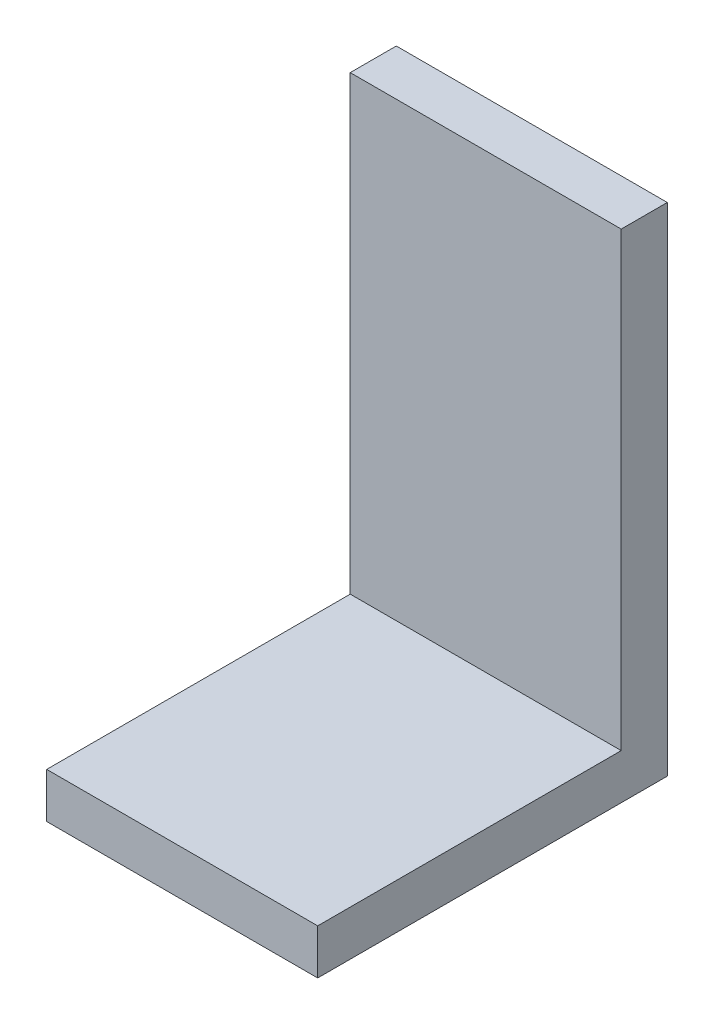
ISO-10303-21;
HEADER;
FILE_DESCRIPTION(('STEP AP214'),'2;1');
FILE_NAME('part.step','',(''),(''),'','','');
FILE_SCHEMA(('AUTOMOTIVE_DESIGN { 1 0 10303 214 1 1 1 1 }'));
ENDSEC;
DATA;
#1=APPLICATION_CONTEXT('core data for automotive mechanical design processes');
#2=APPLICATION_PROTOCOL_DEFINITION('international standard','automotive_design',2000,#1);
#3=PRODUCT_CONTEXT('',#1,'mechanical');
#4=PRODUCT('Part','Part','',(#3));
#5=PRODUCT_RELATED_PRODUCT_CATEGORY('part','',(#4));
#6=PRODUCT_DEFINITION_FORMATION('','',#4);
#7=PRODUCT_DEFINITION_CONTEXT('part definition',#1,'design');
#8=PRODUCT_DEFINITION('design','',#6,#7);
#9=PRODUCT_DEFINITION_SHAPE('','',#8);
#10=(LENGTH_UNIT() NAMED_UNIT(*) SI_UNIT(.MILLI.,.METRE.));
#11=(NAMED_UNIT(*) PLANE_ANGLE_UNIT() SI_UNIT($,.RADIAN.));
#12=(NAMED_UNIT(*) SI_UNIT($,.STERADIAN.) SOLID_ANGLE_UNIT());
#13=UNCERTAINTY_MEASURE_WITH_UNIT(LENGTH_MEASURE(1.E-05),#10,'distance_accuracy_value','');
#14=(GEOMETRIC_REPRESENTATION_CONTEXT(3) GLOBAL_UNCERTAINTY_ASSIGNED_CONTEXT((#13)) GLOBAL_UNIT_ASSIGNED_CONTEXT((#10,
#11,#12)) REPRESENTATION_CONTEXT('',''));
#15=CARTESIAN_POINT('',(0.,0.,0.));
#16=DIRECTION('',(0.,0.,1.));
#17=DIRECTION('',(1.,0.,0.));
#18=AXIS2_PLACEMENT_3D('',#15,#16,#17);
#19=CARTESIAN_POINT('',(0.9,-4.55,0.));
#20=DIRECTION('',(1.,0.,0.));
#21=DIRECTION('',(0.,0.,1.));
#22=AXIS2_PLACEMENT_3D('',#19,#20,#21);
#23=PLANE('',#22);
#24=DIRECTION('',(0.,-1.,0.));
#25=VECTOR('',#24,1.);
#26=CARTESIAN_POINT('',(0.9,-4.,0.));
#27=LINE('',#26,#25);
#28=CARTESIAN_POINT('',(0.9,-4.,0.));
#29=VERTEX_POINT('',#28);
#30=CARTESIAN_POINT('',(0.9,-4.55,0.));
#31=VERTEX_POINT('',#30);
#32=EDGE_CURVE('E11',#29,#31,#27,.T.);
#33=ORIENTED_EDGE('',*,*,#32,.F.);
#34=DIRECTION('',(0.,0.,-1.));
#35=VECTOR('',#34,1.);
#36=CARTESIAN_POINT('',(0.9,-4.,0.051));
#37=LINE('',#36,#35);
#38=CARTESIAN_POINT('',(0.9,-4.,0.051));
#39=VERTEX_POINT('',#38);
#40=EDGE_CURVE('E24',#39,#29,#37,.T.);
#41=ORIENTED_EDGE('',*,*,#40,.F.);
#42=DIRECTION('',(0.,1.,0.));
#43=VECTOR('',#42,1.);
#44=CARTESIAN_POINT('',(0.9,-4.5,0.051));
#45=LINE('',#44,#43);
#46=CARTESIAN_POINT('',(0.9,-4.5,0.051));
#47=VERTEX_POINT('',#46);
#48=EDGE_CURVE('E87',#47,#39,#45,.T.);
#49=ORIENTED_EDGE('',*,*,#48,.F.);
#50=DIRECTION('',(0.,0.,-1.));
#51=VECTOR('',#50,1.);
#52=CARTESIAN_POINT('',(0.9,-4.5,0.387));
#53=LINE('',#52,#51);
#54=CARTESIAN_POINT('',(0.9,-4.5,0.387));
#55=VERTEX_POINT('',#54);
#56=EDGE_CURVE('E114',#55,#47,#53,.T.);
#57=ORIENTED_EDGE('',*,*,#56,.F.);
#58=DIRECTION('',(0.,1.,0.));
#59=VECTOR('',#58,1.);
#60=CARTESIAN_POINT('',(0.9,-4.55,0.387));
#61=LINE('',#60,#59);
#62=CARTESIAN_POINT('',(0.9,-4.55,0.387));
#63=VERTEX_POINT('',#62);
#64=EDGE_CURVE('E111',#63,#55,#61,.T.);
#65=ORIENTED_EDGE('',*,*,#64,.F.);
#66=DIRECTION('',(0.,0.,1.));
#67=VECTOR('',#66,1.);
#68=CARTESIAN_POINT('',(0.9,-4.55,0.));
#69=LINE('',#68,#67);
#70=EDGE_CURVE('E108',#31,#63,#69,.T.);
#71=ORIENTED_EDGE('',*,*,#70,.F.);
#72=EDGE_LOOP('',(#33,#41,#49,#57,#65,#71));
#73=FACE_BOUND('',#72,.T.);
#74=ADVANCED_FACE('F17',(#73),#23,.T.);
#75=CARTESIAN_POINT('',(0.6,-4.,0.));
#76=DIRECTION('',(-1.,0.,0.));
#77=DIRECTION('',(0.,0.,1.));
#78=AXIS2_PLACEMENT_3D('',#75,#76,#77);
#79=PLANE('',#78);
#80=DIRECTION('',(0.,1.,0.));
#81=VECTOR('',#80,1.);
#82=CARTESIAN_POINT('',(0.6,-4.55,0.));
#83=LINE('',#82,#81);
#84=CARTESIAN_POINT('',(0.6,-4.55,0.));
#85=VERTEX_POINT('',#84);
#86=CARTESIAN_POINT('',(0.6,-4.,0.));
#87=VERTEX_POINT('',#86);
#88=EDGE_CURVE('E106',#85,#87,#83,.T.);
#89=ORIENTED_EDGE('',*,*,#88,.F.);
#90=DIRECTION('',(0.,0.,-1.));
#91=VECTOR('',#90,1.);
#92=CARTESIAN_POINT('',(0.6,-4.55,0.387));
#93=LINE('',#92,#91);
#94=CARTESIAN_POINT('',(0.6,-4.55,0.387));
#95=VERTEX_POINT('',#94);
#96=EDGE_CURVE('E103',#95,#85,#93,.T.);
#97=ORIENTED_EDGE('',*,*,#96,.F.);
#98=DIRECTION('',(0.,-1.,0.));
#99=VECTOR('',#98,1.);
#100=CARTESIAN_POINT('',(0.6,-4.5,0.387));
#101=LINE('',#100,#99);
#102=CARTESIAN_POINT('',(0.6,-4.5,0.387));
#103=VERTEX_POINT('',#102);
#104=EDGE_CURVE('E100',#103,#95,#101,.T.);
#105=ORIENTED_EDGE('',*,*,#104,.F.);
#106=DIRECTION('',(0.,0.,1.));
#107=VECTOR('',#106,1.);
#108=CARTESIAN_POINT('',(0.6,-4.5,0.051));
#109=LINE('',#108,#107);
#110=CARTESIAN_POINT('',(0.6,-4.5,0.051));
#111=VERTEX_POINT('',#110);
#112=EDGE_CURVE('E72',#111,#103,#109,.T.);
#113=ORIENTED_EDGE('',*,*,#112,.F.);
#114=DIRECTION('',(0.,-1.,0.));
#115=VECTOR('',#114,1.);
#116=CARTESIAN_POINT('',(0.6,-4.,0.051));
#117=LINE('',#116,#115);
#118=CARTESIAN_POINT('',(0.6,-4.,0.051));
#119=VERTEX_POINT('',#118);
#120=EDGE_CURVE('E66',#119,#111,#117,.T.);
#121=ORIENTED_EDGE('',*,*,#120,.F.);
#122=DIRECTION('',(0.,0.,1.));
#123=VECTOR('',#122,1.);
#124=CARTESIAN_POINT('',(0.6,-4.,0.));
#125=LINE('',#124,#123);
#126=EDGE_CURVE('E69',#87,#119,#125,.T.);
#127=ORIENTED_EDGE('',*,*,#126,.F.);
#128=EDGE_LOOP('',(#89,#97,#105,#113,#121,#127));
#129=FACE_BOUND('',#128,.T.);
#130=ADVANCED_FACE('F68',(#129),#79,.T.);
#131=CARTESIAN_POINT('',(0.9,-4.55,0.387));
#132=DIRECTION('',(0.,0.,1.));
#133=DIRECTION('',(0.,1.,0.));
#134=AXIS2_PLACEMENT_3D('',#131,#132,#133);
#135=PLANE('',#134);
#136=ORIENTED_EDGE('',*,*,#64,.T.);
#137=DIRECTION('',(1.,0.,0.));
#138=VECTOR('',#137,1.);
#139=CARTESIAN_POINT('',(0.6,-4.5,0.387));
#140=LINE('',#139,#138);
#141=EDGE_CURVE('E83',#103,#55,#140,.T.);
#142=ORIENTED_EDGE('',*,*,#141,.F.);
#143=ORIENTED_EDGE('',*,*,#104,.T.);
#144=DIRECTION('',(-1.,0.,0.));
#145=VECTOR('',#144,1.);
#146=CARTESIAN_POINT('',(0.9,-4.55,0.387));
#147=LINE('',#146,#145);
#148=EDGE_CURVE('E88',#63,#95,#147,.T.);
#149=ORIENTED_EDGE('',*,*,#148,.F.);
#150=EDGE_LOOP('',(#136,#142,#143,#149));
#151=FACE_BOUND('',#150,.T.);
#152=ADVANCED_FACE('F125',(#151),#135,.T.);
#153=CARTESIAN_POINT('',(0.9,-4.5,0.051));
#154=DIRECTION('',(0.,0.,1.));
#155=DIRECTION('',(0.,1.,0.));
#156=AXIS2_PLACEMENT_3D('',#153,#154,#155);
#157=PLANE('',#156);
#158=ORIENTED_EDGE('',*,*,#48,.T.);
#159=DIRECTION('',(1.,0.,0.));
#160=VECTOR('',#159,1.);
#161=CARTESIAN_POINT('',(0.6,-4.,0.051));
#162=LINE('',#161,#160);
#163=EDGE_CURVE('E81',#119,#39,#162,.T.);
#164=ORIENTED_EDGE('',*,*,#163,.F.);
#165=ORIENTED_EDGE('',*,*,#120,.T.);
#166=DIRECTION('',(-1.,0.,0.));
#167=VECTOR('',#166,1.);
#168=CARTESIAN_POINT('',(0.9,-4.5,0.051));
#169=LINE('',#168,#167);
#170=EDGE_CURVE('E89',#47,#111,#169,.T.);
#171=ORIENTED_EDGE('',*,*,#170,.F.);
#172=EDGE_LOOP('',(#158,#164,#165,#171));
#173=FACE_BOUND('',#172,.T.);
#174=ADVANCED_FACE('F86',(#173),#157,.T.);
#175=CARTESIAN_POINT('',(0.6,-4.55,0.));
#176=DIRECTION('',(0.,-1.,0.));
#177=DIRECTION('',(0.,0.,1.));
#178=AXIS2_PLACEMENT_3D('',#175,#176,#177);
#179=PLANE('',#178);
#180=DIRECTION('',(-1.,0.,0.));
#181=VECTOR('',#180,1.);
#182=CARTESIAN_POINT('',(0.9,-4.55,0.));
#183=LINE('',#182,#181);
#184=EDGE_CURVE('E93',#31,#85,#183,.T.);
#185=ORIENTED_EDGE('',*,*,#184,.F.);
#186=ORIENTED_EDGE('',*,*,#70,.T.);
#187=ORIENTED_EDGE('',*,*,#148,.T.);
#188=ORIENTED_EDGE('',*,*,#96,.T.);
#189=EDGE_LOOP('',(#185,#186,#187,#188));
#190=FACE_BOUND('',#189,.T.);
#191=ADVANCED_FACE('F121',(#190),#179,.T.);
#192=CARTESIAN_POINT('',(0.9,-4.,0.));
#193=DIRECTION('',(0.,1.,0.));
#194=DIRECTION('',(0.,0.,1.));
#195=AXIS2_PLACEMENT_3D('',#192,#193,#194);
#196=PLANE('',#195);
#197=DIRECTION('',(1.,0.,0.));
#198=VECTOR('',#197,1.);
#199=CARTESIAN_POINT('',(0.6,-4.,0.));
#200=LINE('',#199,#198);
#201=EDGE_CURVE('E82',#87,#29,#200,.T.);
#202=ORIENTED_EDGE('',*,*,#201,.F.);
#203=ORIENTED_EDGE('',*,*,#126,.T.);
#204=ORIENTED_EDGE('',*,*,#163,.T.);
#205=ORIENTED_EDGE('',*,*,#40,.T.);
#206=EDGE_LOOP('',(#202,#203,#204,#205));
#207=FACE_BOUND('',#206,.T.);
#208=ADVANCED_FACE('F80',(#207),#196,.T.);
#209=CARTESIAN_POINT('',(0.9,-4.5,0.051));
#210=DIRECTION('',(0.,1.,0.));
#211=DIRECTION('',(0.,0.,1.));
#212=AXIS2_PLACEMENT_3D('',#209,#210,#211);
#213=PLANE('',#212);
#214=ORIENTED_EDGE('',*,*,#170,.T.);
#215=ORIENTED_EDGE('',*,*,#112,.T.);
#216=ORIENTED_EDGE('',*,*,#141,.T.);
#217=ORIENTED_EDGE('',*,*,#56,.T.);
#218=EDGE_LOOP('',(#214,#215,#216,#217));
#219=FACE_BOUND('',#218,.T.);
#220=ADVANCED_FACE('F127',(#219),#213,.T.);
#221=CARTESIAN_POINT('',(0.6,-4.55,0.));
#222=DIRECTION('',(0.,0.,-1.));
#223=DIRECTION('',(0.,1.,0.));
#224=AXIS2_PLACEMENT_3D('',#221,#222,#223);
#225=PLANE('',#224);
#226=ORIENTED_EDGE('',*,*,#88,.T.);
#227=ORIENTED_EDGE('',*,*,#201,.T.);
#228=ORIENTED_EDGE('',*,*,#32,.T.);
#229=ORIENTED_EDGE('',*,*,#184,.T.);
#230=EDGE_LOOP('',(#226,#227,#228,#229));
#231=FACE_BOUND('',#230,.T.);
#232=ADVANCED_FACE('F117',(#231),#225,.T.);
#233=CLOSED_SHELL('',(#74,#130,#152,#174,#191,#208,#220,#232));
#234=MANIFOLD_SOLID_BREP('B1',#233);
#235=ADVANCED_BREP_SHAPE_REPRESENTATION('',(#18,#234),#14);
#236=SHAPE_DEFINITION_REPRESENTATION(#9,#235);
ENDSEC;
END-ISO-10303-21;
